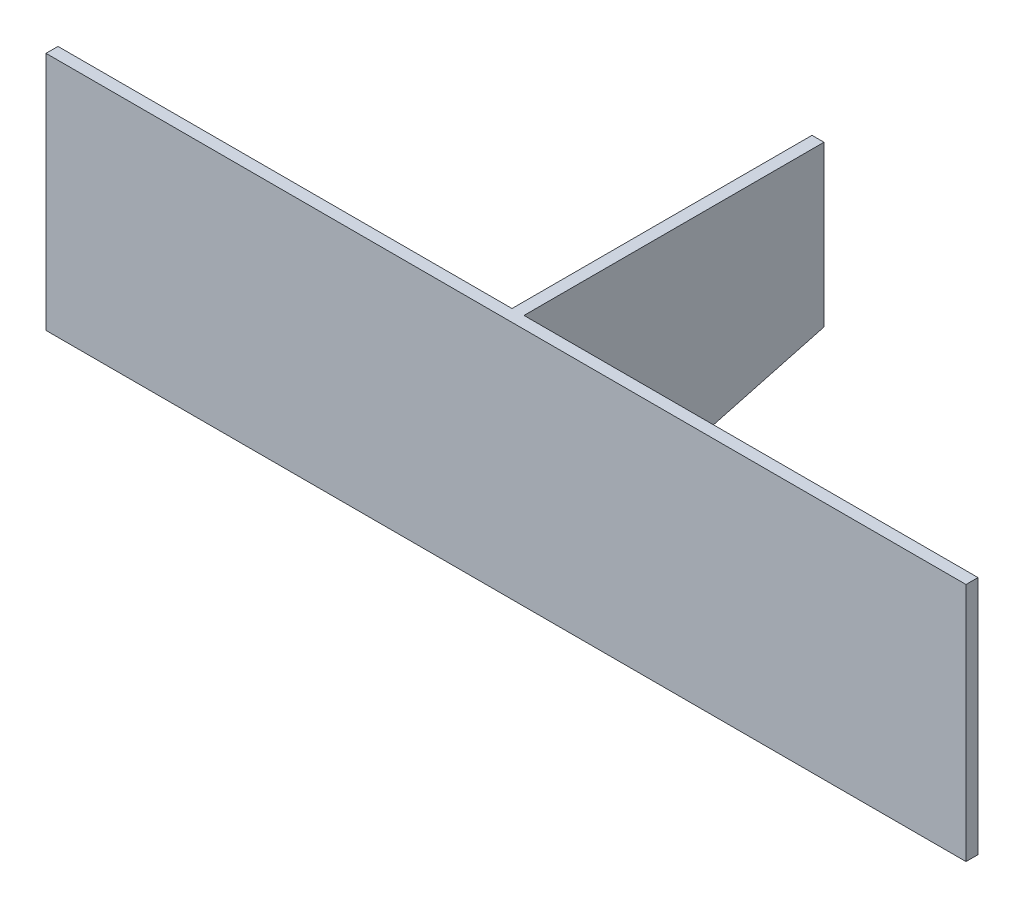
ISO-10303-21;
HEADER;
FILE_DESCRIPTION(('STEP AP214'),'2;1');
FILE_NAME('part.step','',(''),(''),'','','');
FILE_SCHEMA(('AUTOMOTIVE_DESIGN { 1 0 10303 214 1 1 1 1 }'));
ENDSEC;
DATA;
#1=APPLICATION_CONTEXT('core data for automotive mechanical design processes');
#2=APPLICATION_PROTOCOL_DEFINITION('international standard','automotive_design',2000,#1);
#3=PRODUCT_CONTEXT('',#1,'mechanical');
#4=PRODUCT('Part','Part','',(#3));
#5=PRODUCT_RELATED_PRODUCT_CATEGORY('part','',(#4));
#6=PRODUCT_DEFINITION_FORMATION('','',#4);
#7=PRODUCT_DEFINITION_CONTEXT('part definition',#1,'design');
#8=PRODUCT_DEFINITION('design','',#6,#7);
#9=PRODUCT_DEFINITION_SHAPE('','',#8);
#10=(LENGTH_UNIT() NAMED_UNIT(*) SI_UNIT(.MILLI.,.METRE.));
#11=(NAMED_UNIT(*) PLANE_ANGLE_UNIT() SI_UNIT($,.RADIAN.));
#12=(NAMED_UNIT(*) SI_UNIT($,.STERADIAN.) SOLID_ANGLE_UNIT());
#13=UNCERTAINTY_MEASURE_WITH_UNIT(LENGTH_MEASURE(1.E-05),#10,'distance_accuracy_value','');
#14=(GEOMETRIC_REPRESENTATION_CONTEXT(3) GLOBAL_UNCERTAINTY_ASSIGNED_CONTEXT((#13)) GLOBAL_UNIT_ASSIGNED_CONTEXT((#10,
#11,#12)) REPRESENTATION_CONTEXT('',''));
#15=CARTESIAN_POINT('',(0.,0.,0.));
#16=DIRECTION('',(0.,0.,1.));
#17=DIRECTION('',(1.,0.,0.));
#18=AXIS2_PLACEMENT_3D('',#15,#16,#17);
#19=CARTESIAN_POINT('',(0.,0.,0.));
#20=DIRECTION('',(0.,0.,1.));
#21=DIRECTION('',(1.,0.,0.));
#22=AXIS2_PLACEMENT_3D('',#19,#20,#21);
#23=PLANE('',#22);
#24=DIRECTION('',(0.,1.,0.));
#25=VECTOR('',#24,1.);
#26=CARTESIAN_POINT('',(-1.5,30.,0.));
#27=LINE('',#26,#25);
#28=CARTESIAN_POINT('',(-1.5,-30.,0.));
#29=VERTEX_POINT('',#28);
#30=CARTESIAN_POINT('',(-1.5,30.,0.));
#31=VERTEX_POINT('',#30);
#32=EDGE_CURVE('E128',#29,#31,#27,.T.);
#33=ORIENTED_EDGE('',*,*,#32,.F.);
#34=DIRECTION('',(1.,0.,0.));
#35=VECTOR('',#34,1.);
#36=CARTESIAN_POINT('',(-115.,-30.,0.));
#37=LINE('',#36,#35);
#38=CARTESIAN_POINT('',(-115.,-30.,0.));
#39=VERTEX_POINT('',#38);
#40=EDGE_CURVE('E138',#39,#29,#37,.T.);
#41=ORIENTED_EDGE('',*,*,#40,.F.);
#42=DIRECTION('',(0.,-1.,0.));
#43=VECTOR('',#42,1.);
#44=CARTESIAN_POINT('',(-115.,30.,0.));
#45=LINE('',#44,#43);
#46=CARTESIAN_POINT('',(-115.,30.,0.));
#47=VERTEX_POINT('',#46);
#48=EDGE_CURVE('E150',#47,#39,#45,.T.);
#49=ORIENTED_EDGE('',*,*,#48,.F.);
#50=DIRECTION('',(-1.,0.,0.));
#51=VECTOR('',#50,1.);
#52=CARTESIAN_POINT('',(-115.,30.,0.));
#53=LINE('',#52,#51);
#54=EDGE_CURVE('E59',#31,#47,#53,.T.);
#55=ORIENTED_EDGE('',*,*,#54,.F.);
#56=EDGE_LOOP('',(#33,#41,#49,#55));
#57=FACE_BOUND('',#56,.T.);
#58=ADVANCED_FACE('F37',(#57),#23,.F.);
#59=DIRECTION('',(0.,-1.,0.));
#60=VECTOR('',#59,1.);
#61=CARTESIAN_POINT('',(1.5,30.,0.));
#62=LINE('',#61,#60);
#63=CARTESIAN_POINT('',(1.5,30.,0.));
#64=VERTEX_POINT('',#63);
#65=CARTESIAN_POINT('',(1.5,-30.,0.));
#66=VERTEX_POINT('',#65);
#67=EDGE_CURVE('E113',#64,#66,#62,.T.);
#68=ORIENTED_EDGE('',*,*,#67,.F.);
#69=CARTESIAN_POINT('',(115.,30.,0.));
#70=VERTEX_POINT('',#69);
#71=EDGE_CURVE('E147',#70,#64,#53,.T.);
#72=ORIENTED_EDGE('',*,*,#71,.F.);
#73=DIRECTION('',(0.,1.,0.));
#74=VECTOR('',#73,1.);
#75=CARTESIAN_POINT('',(115.,30.,0.));
#76=LINE('',#75,#74);
#77=CARTESIAN_POINT('',(115.,-30.,0.));
#78=VERTEX_POINT('',#77);
#79=EDGE_CURVE('E133',#78,#70,#76,.T.);
#80=ORIENTED_EDGE('',*,*,#79,.F.);
#81=EDGE_CURVE('E152',#66,#78,#37,.T.);
#82=ORIENTED_EDGE('',*,*,#81,.F.);
#83=EDGE_LOOP('',(#68,#72,#80,#82));
#84=FACE_BOUND('',#83,.T.);
#85=ADVANCED_FACE('F172',(#84),#23,.F.);
#86=CARTESIAN_POINT('',(115.,30.,3.));
#87=DIRECTION('',(-1.,0.,0.));
#88=DIRECTION('',(0.,-1.,0.));
#89=AXIS2_PLACEMENT_3D('',#86,#87,#88);
#90=PLANE('',#89);
#91=ORIENTED_EDGE('',*,*,#79,.T.);
#92=DIRECTION('',(0.,0.,-1.));
#93=VECTOR('',#92,1.);
#94=CARTESIAN_POINT('',(115.,30.,3.));
#95=LINE('',#94,#93);
#96=CARTESIAN_POINT('',(115.,30.,3.));
#97=VERTEX_POINT('',#96);
#98=EDGE_CURVE('E45',#97,#70,#95,.T.);
#99=ORIENTED_EDGE('',*,*,#98,.F.);
#100=DIRECTION('',(0.,1.,0.));
#101=VECTOR('',#100,1.);
#102=CARTESIAN_POINT('',(115.,30.,3.));
#103=LINE('',#102,#101);
#104=CARTESIAN_POINT('',(115.,-30.,3.));
#105=VERTEX_POINT('',#104);
#106=EDGE_CURVE('E134',#105,#97,#103,.T.);
#107=ORIENTED_EDGE('',*,*,#106,.F.);
#108=DIRECTION('',(0.,0.,-1.));
#109=VECTOR('',#108,1.);
#110=CARTESIAN_POINT('',(115.,-30.,3.));
#111=LINE('',#110,#109);
#112=EDGE_CURVE('E144',#105,#78,#111,.T.);
#113=ORIENTED_EDGE('',*,*,#112,.T.);
#114=EDGE_LOOP('',(#91,#99,#107,#113));
#115=FACE_BOUND('',#114,.T.);
#116=ADVANCED_FACE('F39',(#115),#90,.F.);
#117=CARTESIAN_POINT('',(-115.,30.,3.));
#118=DIRECTION('',(0.,-1.,0.));
#119=DIRECTION('',(0.,0.,-1.));
#120=AXIS2_PLACEMENT_3D('',#117,#118,#119);
#121=PLANE('',#120);
#122=ORIENTED_EDGE('',*,*,#71,.T.);
#123=DIRECTION('',(0.,0.,1.));
#124=VECTOR('',#123,1.);
#125=CARTESIAN_POINT('',(1.5,30.,-75.));
#126=LINE('',#125,#124);
#127=CARTESIAN_POINT('',(1.5,30.,-75.));
#128=VERTEX_POINT('',#127);
#129=EDGE_CURVE('E120',#128,#64,#126,.T.);
#130=ORIENTED_EDGE('',*,*,#129,.F.);
#131=DIRECTION('',(1.,0.,0.));
#132=VECTOR('',#131,1.);
#133=CARTESIAN_POINT('',(1.5,30.,-75.));
#134=LINE('',#133,#132);
#135=CARTESIAN_POINT('',(-1.5,30.,-75.));
#136=VERTEX_POINT('',#135);
#137=EDGE_CURVE('E118',#136,#128,#134,.T.);
#138=ORIENTED_EDGE('',*,*,#137,.F.);
#139=DIRECTION('',(0.,0.,1.));
#140=VECTOR('',#139,1.);
#141=CARTESIAN_POINT('',(-1.5,30.,-75.));
#142=LINE('',#141,#140);
#143=EDGE_CURVE('E122',#136,#31,#142,.T.);
#144=ORIENTED_EDGE('',*,*,#143,.T.);
#145=ORIENTED_EDGE('',*,*,#54,.T.);
#146=DIRECTION('',(0.,0.,-1.));
#147=VECTOR('',#146,1.);
#148=CARTESIAN_POINT('',(-115.,30.,3.));
#149=LINE('',#148,#147);
#150=CARTESIAN_POINT('',(-115.,30.,3.));
#151=VERTEX_POINT('',#150);
#152=EDGE_CURVE('E159',#151,#47,#149,.T.);
#153=ORIENTED_EDGE('',*,*,#152,.F.);
#154=DIRECTION('',(-1.,0.,0.));
#155=VECTOR('',#154,1.);
#156=CARTESIAN_POINT('',(-115.,30.,3.));
#157=LINE('',#156,#155);
#158=EDGE_CURVE('E137',#97,#151,#157,.T.);
#159=ORIENTED_EDGE('',*,*,#158,.F.);
#160=ORIENTED_EDGE('',*,*,#98,.T.);
#161=EDGE_LOOP('',(#122,#130,#138,#144,#145,#153,#159,#160));
#162=FACE_BOUND('',#161,.T.);
#163=ADVANCED_FACE('F164',(#162),#121,.F.);
#164=CARTESIAN_POINT('',(-115.,30.,3.));
#165=DIRECTION('',(1.,0.,0.));
#166=DIRECTION('',(0.,1.,0.));
#167=AXIS2_PLACEMENT_3D('',#164,#165,#166);
#168=PLANE('',#167);
#169=ORIENTED_EDGE('',*,*,#48,.T.);
#170=DIRECTION('',(0.,0.,-1.));
#171=VECTOR('',#170,1.);
#172=CARTESIAN_POINT('',(-115.,-30.,3.));
#173=LINE('',#172,#171);
#174=CARTESIAN_POINT('',(-115.,-30.,3.));
#175=VERTEX_POINT('',#174);
#176=EDGE_CURVE('E156',#175,#39,#173,.T.);
#177=ORIENTED_EDGE('',*,*,#176,.F.);
#178=DIRECTION('',(0.,-1.,0.));
#179=VECTOR('',#178,1.);
#180=CARTESIAN_POINT('',(-115.,30.,3.));
#181=LINE('',#180,#179);
#182=EDGE_CURVE('E140',#151,#175,#181,.T.);
#183=ORIENTED_EDGE('',*,*,#182,.F.);
#184=ORIENTED_EDGE('',*,*,#152,.T.);
#185=EDGE_LOOP('',(#169,#177,#183,#184));
#186=FACE_BOUND('',#185,.T.);
#187=ADVANCED_FACE('F184',(#186),#168,.F.);
#188=CARTESIAN_POINT('',(-115.,-30.,3.));
#189=DIRECTION('',(0.,1.,0.));
#190=DIRECTION('',(0.,0.,1.));
#191=AXIS2_PLACEMENT_3D('',#188,#189,#190);
#192=PLANE('',#191);
#193=ORIENTED_EDGE('',*,*,#40,.T.);
#194=DIRECTION('',(1.,0.,0.));
#195=VECTOR('',#194,1.);
#196=CARTESIAN_POINT('',(-73.5,-30.,0.));
#197=LINE('',#196,#195);
#198=EDGE_CURVE('E114',#29,#66,#197,.T.);
#199=ORIENTED_EDGE('',*,*,#198,.T.);
#200=ORIENTED_EDGE('',*,*,#81,.T.);
#201=ORIENTED_EDGE('',*,*,#112,.F.);
#202=DIRECTION('',(1.,0.,0.));
#203=VECTOR('',#202,1.);
#204=CARTESIAN_POINT('',(-115.,-30.,3.));
#205=LINE('',#204,#203);
#206=EDGE_CURVE('E142',#175,#105,#205,.T.);
#207=ORIENTED_EDGE('',*,*,#206,.F.);
#208=ORIENTED_EDGE('',*,*,#176,.T.);
#209=EDGE_LOOP('',(#193,#199,#200,#201,#207,#208));
#210=FACE_BOUND('',#209,.T.);
#211=ADVANCED_FACE('F174',(#210),#192,.F.);
#212=CARTESIAN_POINT('',(0.,0.,3.));
#213=DIRECTION('',(0.,0.,1.));
#214=DIRECTION('',(1.,0.,0.));
#215=AXIS2_PLACEMENT_3D('',#212,#213,#214);
#216=PLANE('',#215);
#217=ORIENTED_EDGE('',*,*,#106,.T.);
#218=ORIENTED_EDGE('',*,*,#158,.T.);
#219=ORIENTED_EDGE('',*,*,#182,.T.);
#220=ORIENTED_EDGE('',*,*,#206,.T.);
#221=EDGE_LOOP('',(#217,#218,#219,#220));
#222=FACE_BOUND('',#221,.T.);
#223=ADVANCED_FACE('F187',(#222),#216,.T.);
#224=CARTESIAN_POINT('',(-1.5,30.,-75.));
#225=DIRECTION('',(1.,0.,0.));
#226=DIRECTION('',(0.,0.,-1.));
#227=AXIS2_PLACEMENT_3D('',#224,#225,#226);
#228=PLANE('',#227);
#229=DIRECTION('',(0.,1.,0.));
#230=VECTOR('',#229,1.);
#231=CARTESIAN_POINT('',(-1.5,30.,-75.));
#232=LINE('',#231,#230);
#233=CARTESIAN_POINT('',(-1.5,-10.,-75.));
#234=VERTEX_POINT('',#233);
#235=EDGE_CURVE('E124',#234,#136,#232,.T.);
#236=ORIENTED_EDGE('',*,*,#235,.F.);
#237=DIRECTION('',(0.,-0.257662650560332,0.966234939601246));
#238=VECTOR('',#237,1.);
#239=CARTESIAN_POINT('',(-1.5,-7.34439834024896,-84.9585062240664));
#240=LINE('',#239,#238);
#241=EDGE_CURVE('E51',#234,#29,#240,.T.);
#242=ORIENTED_EDGE('',*,*,#241,.T.);
#243=ORIENTED_EDGE('',*,*,#32,.T.);
#244=ORIENTED_EDGE('',*,*,#143,.F.);
#245=EDGE_LOOP('',(#236,#242,#243,#244));
#246=FACE_BOUND('',#245,.T.);
#247=ADVANCED_FACE('F181',(#246),#228,.F.);
#248=CARTESIAN_POINT('',(1.5,30.,-75.));
#249=DIRECTION('',(-1.,0.,0.));
#250=DIRECTION('',(0.,0.,1.));
#251=AXIS2_PLACEMENT_3D('',#248,#249,#250);
#252=PLANE('',#251);
#253=ORIENTED_EDGE('',*,*,#67,.T.);
#254=DIRECTION('',(0.,-0.257662650560332,0.966234939601246));
#255=VECTOR('',#254,1.);
#256=CARTESIAN_POINT('',(1.5,-10.,-75.));
#257=LINE('',#256,#255);
#258=CARTESIAN_POINT('',(1.5,-10.,-75.));
#259=VERTEX_POINT('',#258);
#260=EDGE_CURVE('E102',#259,#66,#257,.T.);
#261=ORIENTED_EDGE('',*,*,#260,.F.);
#262=DIRECTION('',(0.,-1.,0.));
#263=VECTOR('',#262,1.);
#264=CARTESIAN_POINT('',(1.5,30.,-75.));
#265=LINE('',#264,#263);
#266=EDGE_CURVE('E112',#128,#259,#265,.T.);
#267=ORIENTED_EDGE('',*,*,#266,.F.);
#268=ORIENTED_EDGE('',*,*,#129,.T.);
#269=EDGE_LOOP('',(#253,#261,#267,#268));
#270=FACE_BOUND('',#269,.T.);
#271=ADVANCED_FACE('F110',(#270),#252,.F.);
#272=CARTESIAN_POINT('',(0.,0.,-75.));
#273=DIRECTION('',(0.,0.,-1.));
#274=DIRECTION('',(-1.,0.,0.));
#275=AXIS2_PLACEMENT_3D('',#272,#273,#274);
#276=PLANE('',#275);
#277=DIRECTION('',(1.,0.,0.));
#278=VECTOR('',#277,1.);
#279=CARTESIAN_POINT('',(0.,-10.,-75.));
#280=LINE('',#279,#278);
#281=EDGE_CURVE('E11',#234,#259,#280,.T.);
#282=ORIENTED_EDGE('',*,*,#281,.F.);
#283=ORIENTED_EDGE('',*,*,#235,.T.);
#284=ORIENTED_EDGE('',*,*,#137,.T.);
#285=ORIENTED_EDGE('',*,*,#266,.T.);
#286=EDGE_LOOP('',(#282,#283,#284,#285));
#287=FACE_BOUND('',#286,.T.);
#288=ADVANCED_FACE('F116',(#287),#276,.T.);
#289=CARTESIAN_POINT('',(-73.5,-10.,-75.));
#290=DIRECTION('',(0.,0.966234939601246,0.257662650560332));
#291=DIRECTION('',(0.,-0.257662650560332,0.966234939601246));
#292=AXIS2_PLACEMENT_3D('',#289,#290,#291);
#293=PLANE('',#292);
#294=ORIENTED_EDGE('',*,*,#281,.T.);
#295=ORIENTED_EDGE('',*,*,#260,.T.);
#296=ORIENTED_EDGE('',*,*,#198,.F.);
#297=ORIENTED_EDGE('',*,*,#241,.F.);
#298=EDGE_LOOP('',(#294,#295,#296,#297));
#299=FACE_BOUND('',#298,.T.);
#300=ADVANCED_FACE('F101',(#299),#293,.F.);
#301=CLOSED_SHELL('',(#58,#85,#116,#163,#187,#211,#223,#247,#271,#288,#300));
#302=MANIFOLD_SOLID_BREP('B2',#301);
#303=ADVANCED_BREP_SHAPE_REPRESENTATION('',(#18,#302),#14);
#304=SHAPE_DEFINITION_REPRESENTATION(#9,#303);
ENDSEC;
END-ISO-10303-21;
